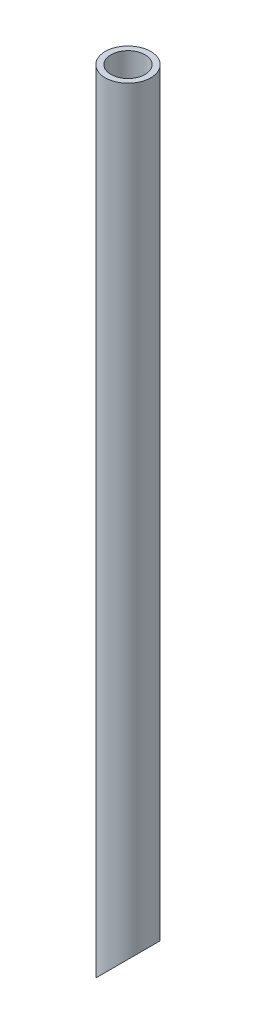
ISO-10303-21;
HEADER;
FILE_DESCRIPTION(('STEP AP214'),'2;1');
FILE_NAME('part.step','',(''),(''),'','','');
FILE_SCHEMA(('AUTOMOTIVE_DESIGN { 1 0 10303 214 1 1 1 1 }'));
ENDSEC;
DATA;
#1=APPLICATION_CONTEXT('core data for automotive mechanical design processes');
#2=APPLICATION_PROTOCOL_DEFINITION('international standard','automotive_design',2000,#1);
#3=PRODUCT_CONTEXT('',#1,'mechanical');
#4=PRODUCT('Part','Part','',(#3));
#5=PRODUCT_RELATED_PRODUCT_CATEGORY('part','',(#4));
#6=PRODUCT_DEFINITION_FORMATION('','',#4);
#7=PRODUCT_DEFINITION_CONTEXT('part definition',#1,'design');
#8=PRODUCT_DEFINITION('design','',#6,#7);
#9=PRODUCT_DEFINITION_SHAPE('','',#8);
#10=(LENGTH_UNIT() NAMED_UNIT(*) SI_UNIT(.MILLI.,.METRE.));
#11=(NAMED_UNIT(*) PLANE_ANGLE_UNIT() SI_UNIT($,.RADIAN.));
#12=(NAMED_UNIT(*) SI_UNIT($,.STERADIAN.) SOLID_ANGLE_UNIT());
#13=UNCERTAINTY_MEASURE_WITH_UNIT(LENGTH_MEASURE(1.E-05),#10,'distance_accuracy_value','');
#14=(GEOMETRIC_REPRESENTATION_CONTEXT(3) GLOBAL_UNCERTAINTY_ASSIGNED_CONTEXT((#13)) GLOBAL_UNIT_ASSIGNED_CONTEXT((#10,
#11,#12)) REPRESENTATION_CONTEXT('',''));
#15=CARTESIAN_POINT('',(0.,0.,0.));
#16=DIRECTION('',(0.,0.,1.));
#17=DIRECTION('',(1.,0.,0.));
#18=AXIS2_PLACEMENT_3D('',#15,#16,#17);
#19=CARTESIAN_POINT('',(0.,70.,0.));
#20=DIRECTION('',(0.,1.,0.));
#21=DIRECTION('',(0.,0.,1.));
#22=AXIS2_PLACEMENT_3D('',#19,#20,#21);
#23=PLANE('',#22);
#24=CARTESIAN_POINT('',(0.,70.,0.));
#25=DIRECTION('',(0.,1.,0.));
#26=DIRECTION('',(0.,0.,1.));
#27=AXIS2_PLACEMENT_3D('',#24,#25,#26);
#28=CIRCLE('',#27,2.);
#29=CARTESIAN_POINT('',(0.,70.,2.));
#30=VERTEX_POINT('',#29);
#31=EDGE_CURVE('E10',#30,#30,#28,.T.);
#32=ORIENTED_EDGE('',*,*,#31,.T.);
#33=EDGE_LOOP('',(#32));
#34=FACE_BOUND('',#33,.T.);
#35=CARTESIAN_POINT('',(0.,70.,0.));
#36=DIRECTION('',(0.,1.,0.));
#37=DIRECTION('',(0.,0.,1.));
#38=AXIS2_PLACEMENT_3D('',#35,#36,#37);
#39=CIRCLE('',#38,1.5);
#40=CARTESIAN_POINT('',(0.,70.,1.5));
#41=VERTEX_POINT('',#40);
#42=EDGE_CURVE('E43',#41,#41,#39,.T.);
#43=ORIENTED_EDGE('',*,*,#42,.F.);
#44=EDGE_LOOP('',(#43));
#45=FACE_BOUND('',#44,.T.);
#46=ADVANCED_FACE('F35',(#34,#45),#23,.T.);
#47=CARTESIAN_POINT('',(0.,70.,0.));
#48=DIRECTION('',(0.,-1.,0.));
#49=DIRECTION('',(0.,0.,-1.));
#50=AXIS2_PLACEMENT_3D('',#47,#48,#49);
#51=CYLINDRICAL_SURFACE('',#50,2.);
#52=ORIENTED_EDGE('',*,*,#31,.F.);
#53=EDGE_LOOP('',(#52));
#54=FACE_BOUND('',#53,.T.);
#55=CARTESIAN_POINT('',(0.,1.99999999999999,0.));
#56=DIRECTION('',(-0.707106781186544,0.707106781186551,0.));
#57=DIRECTION('',(-0.707106781186551,-0.707106781186544,0.));
#58=AXIS2_PLACEMENT_3D('',#55,#56,#57);
#59=ELLIPSE('',#58,2.82842712474618,2.);
#60=CARTESIAN_POINT('',(-2.,0.,0.));
#61=VERTEX_POINT('',#60);
#62=EDGE_CURVE('E47',#61,#61,#59,.T.);
#63=ORIENTED_EDGE('',*,*,#62,.T.);
#64=EDGE_LOOP('',(#63));
#65=FACE_BOUND('',#64,.T.);
#66=ADVANCED_FACE('F37',(#54,#65),#51,.T.);
#67=CARTESIAN_POINT('',(0.,70.,0.));
#68=DIRECTION('',(0.,-1.,0.));
#69=DIRECTION('',(0.,0.,-1.));
#70=AXIS2_PLACEMENT_3D('',#67,#68,#69);
#71=CYLINDRICAL_SURFACE('',#70,1.5);
#72=CARTESIAN_POINT('',(0.,1.99999999999999,0.));
#73=DIRECTION('',(-0.707106781186544,0.707106781186551,0.));
#74=DIRECTION('',(-0.707106781186551,-0.707106781186544,0.));
#75=AXIS2_PLACEMENT_3D('',#72,#73,#74);
#76=ELLIPSE('',#75,2.12132034355963,1.5);
#77=CARTESIAN_POINT('',(-1.5,0.500000000000003,0.));
#78=VERTEX_POINT('',#77);
#79=EDGE_CURVE('E39',#78,#78,#76,.T.);
#80=ORIENTED_EDGE('',*,*,#79,.F.);
#81=EDGE_LOOP('',(#80));
#82=FACE_BOUND('',#81,.T.);
#83=ORIENTED_EDGE('',*,*,#42,.T.);
#84=EDGE_LOOP('',(#83));
#85=FACE_BOUND('',#84,.T.);
#86=ADVANCED_FACE('F59',(#82,#85),#71,.F.);
#87=CARTESIAN_POINT('',(-2.,0.,-2.));
#88=DIRECTION('',(-0.707106781186544,0.707106781186551,0.));
#89=DIRECTION('',(-0.707106781186551,-0.707106781186544,0.));
#90=AXIS2_PLACEMENT_3D('',#87,#88,#89);
#91=PLANE('',#90);
#92=ORIENTED_EDGE('',*,*,#79,.T.);
#93=EDGE_LOOP('',(#92));
#94=FACE_BOUND('',#93,.T.);
#95=ORIENTED_EDGE('',*,*,#62,.F.);
#96=EDGE_LOOP('',(#95));
#97=FACE_BOUND('',#96,.T.);
#98=ADVANCED_FACE('F56',(#94,#97),#91,.F.);
#99=CLOSED_SHELL('',(#46,#66,#86,#98));
#100=MANIFOLD_SOLID_BREP('B2',#99);
#101=ADVANCED_BREP_SHAPE_REPRESENTATION('',(#18,#100),#14);
#102=SHAPE_DEFINITION_REPRESENTATION(#9,#101);
ENDSEC;
END-ISO-10303-21;
